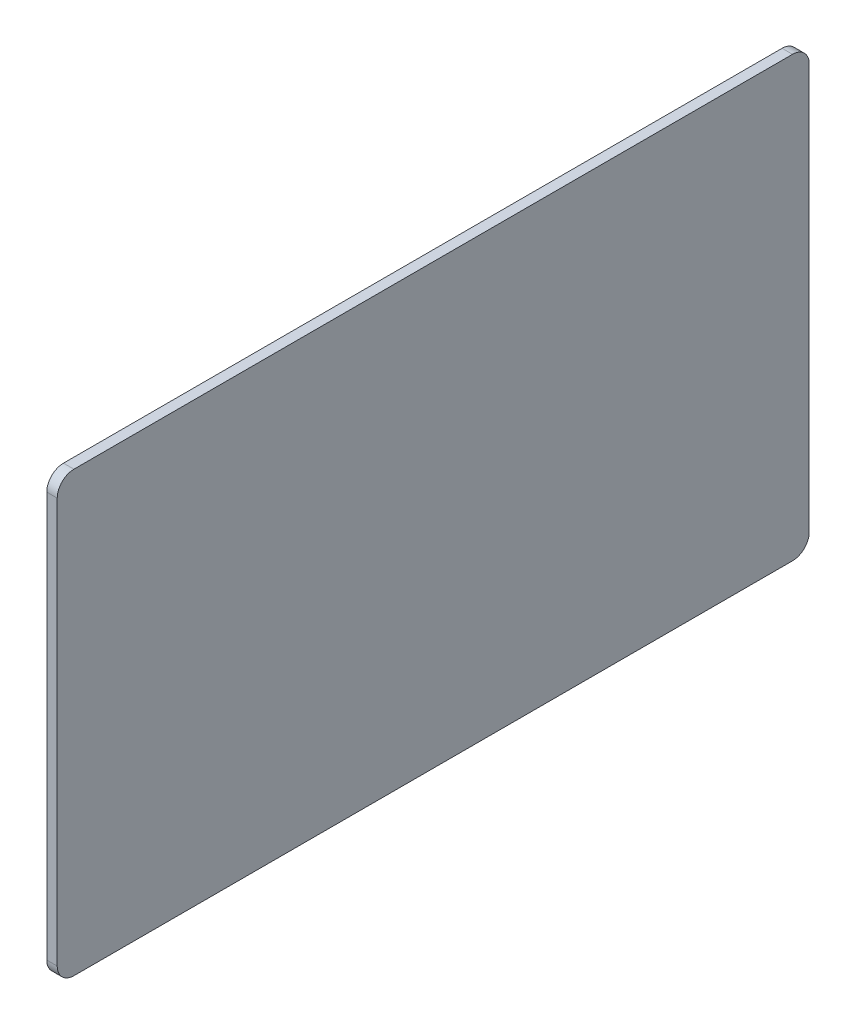
ISO-10303-21;
HEADER;
FILE_DESCRIPTION(('STEP AP214'),'2;1');
FILE_NAME('part.step','',(''),(''),'','','');
FILE_SCHEMA(('AUTOMOTIVE_DESIGN { 1 0 10303 214 1 1 1 1 }'));
ENDSEC;
DATA;
#1=APPLICATION_CONTEXT('core data for automotive mechanical design processes');
#2=APPLICATION_PROTOCOL_DEFINITION('international standard','automotive_design',2000,#1);
#3=PRODUCT_CONTEXT('',#1,'mechanical');
#4=PRODUCT('Part','Part','',(#3));
#5=PRODUCT_RELATED_PRODUCT_CATEGORY('part','',(#4));
#6=PRODUCT_DEFINITION_FORMATION('','',#4);
#7=PRODUCT_DEFINITION_CONTEXT('part definition',#1,'design');
#8=PRODUCT_DEFINITION('design','',#6,#7);
#9=PRODUCT_DEFINITION_SHAPE('','',#8);
#10=(LENGTH_UNIT() NAMED_UNIT(*) SI_UNIT(.MILLI.,.METRE.));
#11=(NAMED_UNIT(*) PLANE_ANGLE_UNIT() SI_UNIT($,.RADIAN.));
#12=(NAMED_UNIT(*) SI_UNIT($,.STERADIAN.) SOLID_ANGLE_UNIT());
#13=UNCERTAINTY_MEASURE_WITH_UNIT(LENGTH_MEASURE(1.E-05),#10,'distance_accuracy_value','');
#14=(GEOMETRIC_REPRESENTATION_CONTEXT(3) GLOBAL_UNCERTAINTY_ASSIGNED_CONTEXT((#13)) GLOBAL_UNIT_ASSIGNED_CONTEXT((#10,
#11,#12)) REPRESENTATION_CONTEXT('',''));
#15=CARTESIAN_POINT('',(0.,0.,0.));
#16=DIRECTION('',(0.,0.,1.));
#17=DIRECTION('',(1.,0.,0.));
#18=AXIS2_PLACEMENT_3D('',#15,#16,#17);
#19=CARTESIAN_POINT('',(1.5875,33.3375,-57.15));
#20=DIRECTION('',(0.,0.,1.));
#21=DIRECTION('',(1.,0.,0.));
#22=AXIS2_PLACEMENT_3D('',#19,#20,#21);
#23=PLANE('',#22);
#24=DIRECTION('',(0.,1.,0.));
#25=VECTOR('',#24,1.);
#26=CARTESIAN_POINT('',(1.5875,33.3375,-57.15));
#27=LINE('',#26,#25);
#28=CARTESIAN_POINT('',(1.5875,-30.7975,-57.15));
#29=VERTEX_POINT('',#28);
#30=CARTESIAN_POINT('',(1.5875,30.7975,-57.15));
#31=VERTEX_POINT('',#30);
#32=EDGE_CURVE('E125',#29,#31,#27,.T.);
#33=ORIENTED_EDGE('',*,*,#32,.F.);
#34=DIRECTION('',(-1.,0.,0.));
#35=VECTOR('',#34,1.);
#36=CARTESIAN_POINT('',(1.5875,-30.7975,-57.15));
#37=LINE('',#36,#35);
#38=CARTESIAN_POINT('',(0.,-30.7975,-57.15));
#39=VERTEX_POINT('',#38);
#40=EDGE_CURVE('E109',#29,#39,#37,.T.);
#41=ORIENTED_EDGE('',*,*,#40,.T.);
#42=DIRECTION('',(0.,1.,0.));
#43=VECTOR('',#42,1.);
#44=CARTESIAN_POINT('',(0.,33.3375,-57.15));
#45=LINE('',#44,#43);
#46=CARTESIAN_POINT('',(0.,30.7975,-57.15));
#47=VERTEX_POINT('',#46);
#48=EDGE_CURVE('E122',#39,#47,#45,.T.);
#49=ORIENTED_EDGE('',*,*,#48,.T.);
#50=DIRECTION('',(-1.,0.,0.));
#51=VECTOR('',#50,1.);
#52=CARTESIAN_POINT('',(1.5875,30.7975,-57.15));
#53=LINE('',#52,#51);
#54=EDGE_CURVE('E128',#47,#31,#53,.F.);
#55=ORIENTED_EDGE('',*,*,#54,.T.);
#56=EDGE_LOOP('',(#33,#41,#49,#55));
#57=FACE_BOUND('',#56,.T.);
#58=ADVANCED_FACE('F39',(#57),#23,.F.);
#59=CARTESIAN_POINT('',(1.5875,33.3375,57.15));
#60=DIRECTION('',(0.,-1.,0.));
#61=DIRECTION('',(0.,0.,-1.));
#62=AXIS2_PLACEMENT_3D('',#59,#60,#61);
#63=PLANE('',#62);
#64=DIRECTION('',(0.,0.,1.));
#65=VECTOR('',#64,1.);
#66=CARTESIAN_POINT('',(1.5875,33.3375,57.15));
#67=LINE('',#66,#65);
#68=CARTESIAN_POINT('',(1.5875,33.3375,-54.61));
#69=VERTEX_POINT('',#68);
#70=CARTESIAN_POINT('',(1.5875,33.3375,54.61));
#71=VERTEX_POINT('',#70);
#72=EDGE_CURVE('E196',#69,#71,#67,.T.);
#73=ORIENTED_EDGE('',*,*,#72,.F.);
#74=DIRECTION('',(-1.,0.,0.));
#75=VECTOR('',#74,1.);
#76=CARTESIAN_POINT('',(1.5875,33.3375,-54.61));
#77=LINE('',#76,#75);
#78=CARTESIAN_POINT('',(0.,33.3375,-54.61));
#79=VERTEX_POINT('',#78);
#80=EDGE_CURVE('E176',#69,#79,#77,.T.);
#81=ORIENTED_EDGE('',*,*,#80,.T.);
#82=DIRECTION('',(0.,0.,1.));
#83=VECTOR('',#82,1.);
#84=CARTESIAN_POINT('',(0.,33.3375,57.15));
#85=LINE('',#84,#83);
#86=CARTESIAN_POINT('',(0.,33.3375,54.61));
#87=VERTEX_POINT('',#86);
#88=EDGE_CURVE('E133',#79,#87,#85,.T.);
#89=ORIENTED_EDGE('',*,*,#88,.T.);
#90=DIRECTION('',(-1.,0.,0.));
#91=VECTOR('',#90,1.);
#92=CARTESIAN_POINT('',(1.5875,33.3375,54.61));
#93=LINE('',#92,#91);
#94=EDGE_CURVE('E173',#87,#71,#93,.F.);
#95=ORIENTED_EDGE('',*,*,#94,.T.);
#96=EDGE_LOOP('',(#73,#81,#89,#95));
#97=FACE_BOUND('',#96,.T.);
#98=ADVANCED_FACE('F208',(#97),#63,.F.);
#99=CARTESIAN_POINT('',(1.5875,33.3375,57.15));
#100=DIRECTION('',(0.,0.,-1.));
#101=DIRECTION('',(0.,1.,0.));
#102=AXIS2_PLACEMENT_3D('',#99,#100,#101);
#103=PLANE('',#102);
#104=DIRECTION('',(0.,-1.,0.));
#105=VECTOR('',#104,1.);
#106=CARTESIAN_POINT('',(0.,33.3375,57.15));
#107=LINE('',#106,#105);
#108=CARTESIAN_POINT('',(0.,30.7975,57.15));
#109=VERTEX_POINT('',#108);
#110=CARTESIAN_POINT('',(0.,-30.7975,57.15));
#111=VERTEX_POINT('',#110);
#112=EDGE_CURVE('E137',#109,#111,#107,.T.);
#113=ORIENTED_EDGE('',*,*,#112,.T.);
#114=DIRECTION('',(-1.,0.,0.));
#115=VECTOR('',#114,1.);
#116=CARTESIAN_POINT('',(1.5875,-30.7975,57.15));
#117=LINE('',#116,#115);
#118=CARTESIAN_POINT('',(1.5875,-30.7975,57.15));
#119=VERTEX_POINT('',#118);
#120=EDGE_CURVE('E11',#111,#119,#117,.F.);
#121=ORIENTED_EDGE('',*,*,#120,.T.);
#122=DIRECTION('',(0.,-1.,0.));
#123=VECTOR('',#122,1.);
#124=CARTESIAN_POINT('',(1.5875,33.3375,57.15));
#125=LINE('',#124,#123);
#126=CARTESIAN_POINT('',(1.5875,30.7975,57.15));
#127=VERTEX_POINT('',#126);
#128=EDGE_CURVE('E184',#127,#119,#125,.T.);
#129=ORIENTED_EDGE('',*,*,#128,.F.);
#130=DIRECTION('',(-1.,0.,0.));
#131=VECTOR('',#130,1.);
#132=CARTESIAN_POINT('',(1.5875,30.7975,57.15));
#133=LINE('',#132,#131);
#134=EDGE_CURVE('E48',#127,#109,#133,.T.);
#135=ORIENTED_EDGE('',*,*,#134,.T.);
#136=EDGE_LOOP('',(#113,#121,#129,#135));
#137=FACE_BOUND('',#136,.T.);
#138=ADVANCED_FACE('F183',(#137),#103,.F.);
#139=CARTESIAN_POINT('',(1.5875,-33.3375,57.15));
#140=DIRECTION('',(0.,1.,0.));
#141=DIRECTION('',(0.,0.,1.));
#142=AXIS2_PLACEMENT_3D('',#139,#140,#141);
#143=PLANE('',#142);
#144=DIRECTION('',(0.,0.,-1.));
#145=VECTOR('',#144,1.);
#146=CARTESIAN_POINT('',(0.,-33.3375,57.15));
#147=LINE('',#146,#145);
#148=CARTESIAN_POINT('',(0.,-33.3375,54.61));
#149=VERTEX_POINT('',#148);
#150=CARTESIAN_POINT('',(0.,-33.3375,-54.61));
#151=VERTEX_POINT('',#150);
#152=EDGE_CURVE('E145',#149,#151,#147,.T.);
#153=ORIENTED_EDGE('',*,*,#152,.T.);
#154=DIRECTION('',(-1.,0.,0.));
#155=VECTOR('',#154,1.);
#156=CARTESIAN_POINT('',(1.5875,-33.3375,-54.61));
#157=LINE('',#156,#155);
#158=CARTESIAN_POINT('',(1.5875,-33.3375,-54.61));
#159=VERTEX_POINT('',#158);
#160=EDGE_CURVE('E110',#151,#159,#157,.F.);
#161=ORIENTED_EDGE('',*,*,#160,.T.);
#162=DIRECTION('',(0.,0.,-1.));
#163=VECTOR('',#162,1.);
#164=CARTESIAN_POINT('',(1.5875,-33.3375,57.15));
#165=LINE('',#164,#163);
#166=CARTESIAN_POINT('',(1.5875,-33.3375,54.61));
#167=VERTEX_POINT('',#166);
#168=EDGE_CURVE('E140',#167,#159,#165,.T.);
#169=ORIENTED_EDGE('',*,*,#168,.F.);
#170=DIRECTION('',(-1.,0.,0.));
#171=VECTOR('',#170,1.);
#172=CARTESIAN_POINT('',(1.5875,-33.3375,54.61));
#173=LINE('',#172,#171);
#174=EDGE_CURVE('E116',#167,#149,#173,.T.);
#175=ORIENTED_EDGE('',*,*,#174,.T.);
#176=EDGE_LOOP('',(#153,#161,#169,#175));
#177=FACE_BOUND('',#176,.T.);
#178=ADVANCED_FACE('F192',(#177),#143,.F.);
#179=CARTESIAN_POINT('',(1.5875,0.,0.));
#180=DIRECTION('',(1.,0.,0.));
#181=DIRECTION('',(0.,0.,-1.));
#182=AXIS2_PLACEMENT_3D('',#179,#180,#181);
#183=PLANE('',#182);
#184=ORIENTED_EDGE('',*,*,#168,.T.);
#185=CARTESIAN_POINT('',(1.5875,-30.7975,-54.61));
#186=DIRECTION('',(1.,0.,0.));
#187=DIRECTION('',(0.,0.,-1.));
#188=AXIS2_PLACEMENT_3D('',#185,#186,#187);
#189=CIRCLE('',#188,2.54);
#190=EDGE_CURVE('E170',#159,#29,#189,.T.);
#191=ORIENTED_EDGE('',*,*,#190,.T.);
#192=ORIENTED_EDGE('',*,*,#32,.T.);
#193=CARTESIAN_POINT('',(1.5875,30.7975,-54.61));
#194=DIRECTION('',(1.,0.,0.));
#195=DIRECTION('',(0.,0.,-1.));
#196=AXIS2_PLACEMENT_3D('',#193,#194,#195);
#197=CIRCLE('',#196,2.54);
#198=EDGE_CURVE('E167',#31,#69,#197,.T.);
#199=ORIENTED_EDGE('',*,*,#198,.T.);
#200=ORIENTED_EDGE('',*,*,#72,.T.);
#201=CARTESIAN_POINT('',(1.5875,30.7975,54.61));
#202=DIRECTION('',(1.,0.,0.));
#203=DIRECTION('',(0.,0.,-1.));
#204=AXIS2_PLACEMENT_3D('',#201,#202,#203);
#205=CIRCLE('',#204,2.54);
#206=EDGE_CURVE('E60',#71,#127,#205,.T.);
#207=ORIENTED_EDGE('',*,*,#206,.T.);
#208=ORIENTED_EDGE('',*,*,#128,.T.);
#209=CARTESIAN_POINT('',(1.5875,-30.7975,54.61));
#210=DIRECTION('',(1.,0.,0.));
#211=DIRECTION('',(0.,0.,-1.));
#212=AXIS2_PLACEMENT_3D('',#209,#210,#211);
#213=CIRCLE('',#212,2.54);
#214=EDGE_CURVE('E164',#119,#167,#213,.T.);
#215=ORIENTED_EDGE('',*,*,#214,.T.);
#216=EDGE_LOOP('',(#184,#191,#192,#199,#200,#207,#208,#215));
#217=FACE_BOUND('',#216,.T.);
#218=ADVANCED_FACE('F202',(#217),#183,.T.);
#219=CARTESIAN_POINT('',(0.,0.,0.));
#220=DIRECTION('',(1.,0.,0.));
#221=DIRECTION('',(0.,0.,-1.));
#222=AXIS2_PLACEMENT_3D('',#219,#220,#221);
#223=PLANE('',#222);
#224=ORIENTED_EDGE('',*,*,#48,.F.);
#225=CARTESIAN_POINT('',(0.,-30.7975,-54.61));
#226=DIRECTION('',(1.,0.,0.));
#227=DIRECTION('',(0.,0.,-1.));
#228=AXIS2_PLACEMENT_3D('',#225,#226,#227);
#229=CIRCLE('',#228,2.54);
#230=EDGE_CURVE('E105',#39,#151,#229,.F.);
#231=ORIENTED_EDGE('',*,*,#230,.T.);
#232=ORIENTED_EDGE('',*,*,#152,.F.);
#233=CARTESIAN_POINT('',(0.,-30.7975,54.61));
#234=DIRECTION('',(1.,0.,0.));
#235=DIRECTION('',(0.,0.,-1.));
#236=AXIS2_PLACEMENT_3D('',#233,#234,#235);
#237=CIRCLE('',#236,2.54);
#238=EDGE_CURVE('E152',#149,#111,#237,.F.);
#239=ORIENTED_EDGE('',*,*,#238,.T.);
#240=ORIENTED_EDGE('',*,*,#112,.F.);
#241=CARTESIAN_POINT('',(0.,30.7975,54.61));
#242=DIRECTION('',(1.,0.,0.));
#243=DIRECTION('',(0.,0.,-1.));
#244=AXIS2_PLACEMENT_3D('',#241,#242,#243);
#245=CIRCLE('',#244,2.54);
#246=EDGE_CURVE('E127',#109,#87,#245,.F.);
#247=ORIENTED_EDGE('',*,*,#246,.T.);
#248=ORIENTED_EDGE('',*,*,#88,.F.);
#249=CARTESIAN_POINT('',(0.,30.7975,-54.61));
#250=DIRECTION('',(1.,0.,0.));
#251=DIRECTION('',(0.,0.,-1.));
#252=AXIS2_PLACEMENT_3D('',#249,#250,#251);
#253=CIRCLE('',#252,2.54);
#254=EDGE_CURVE('E117',#79,#47,#253,.F.);
#255=ORIENTED_EDGE('',*,*,#254,.T.);
#256=EDGE_LOOP('',(#224,#231,#232,#239,#240,#247,#248,#255));
#257=FACE_BOUND('',#256,.T.);
#258=ADVANCED_FACE('F130',(#257),#223,.F.);
#259=CARTESIAN_POINT('',(1.5875,-30.7975,-54.61));
#260=DIRECTION('',(-1.,0.,0.));
#261=DIRECTION('',(0.,0.,1.));
#262=AXIS2_PLACEMENT_3D('',#259,#260,#261);
#263=CYLINDRICAL_SURFACE('',#262,2.54);
#264=ORIENTED_EDGE('',*,*,#190,.F.);
#265=ORIENTED_EDGE('',*,*,#160,.F.);
#266=ORIENTED_EDGE('',*,*,#230,.F.);
#267=ORIENTED_EDGE('',*,*,#40,.F.);
#268=EDGE_LOOP('',(#264,#265,#266,#267));
#269=FACE_BOUND('',#268,.T.);
#270=ADVANCED_FACE('F108',(#269),#263,.T.);
#271=CARTESIAN_POINT('',(1.5875,30.7975,-54.61));
#272=DIRECTION('',(-1.,0.,0.));
#273=DIRECTION('',(0.,0.,1.));
#274=AXIS2_PLACEMENT_3D('',#271,#272,#273);
#275=CYLINDRICAL_SURFACE('',#274,2.54);
#276=ORIENTED_EDGE('',*,*,#198,.F.);
#277=ORIENTED_EDGE('',*,*,#54,.F.);
#278=ORIENTED_EDGE('',*,*,#254,.F.);
#279=ORIENTED_EDGE('',*,*,#80,.F.);
#280=EDGE_LOOP('',(#276,#277,#278,#279));
#281=FACE_BOUND('',#280,.T.);
#282=ADVANCED_FACE('F206',(#281),#275,.T.);
#283=CARTESIAN_POINT('',(1.5875,-30.7975,54.61));
#284=DIRECTION('',(-1.,0.,0.));
#285=DIRECTION('',(0.,0.,1.));
#286=AXIS2_PLACEMENT_3D('',#283,#284,#285);
#287=CYLINDRICAL_SURFACE('',#286,2.54);
#288=ORIENTED_EDGE('',*,*,#214,.F.);
#289=ORIENTED_EDGE('',*,*,#120,.F.);
#290=ORIENTED_EDGE('',*,*,#238,.F.);
#291=ORIENTED_EDGE('',*,*,#174,.F.);
#292=EDGE_LOOP('',(#288,#289,#290,#291));
#293=FACE_BOUND('',#292,.T.);
#294=ADVANCED_FACE('F189',(#293),#287,.T.);
#295=CARTESIAN_POINT('',(1.5875,30.7975,54.61));
#296=DIRECTION('',(-1.,0.,0.));
#297=DIRECTION('',(0.,0.,1.));
#298=AXIS2_PLACEMENT_3D('',#295,#296,#297);
#299=CYLINDRICAL_SURFACE('',#298,2.54);
#300=ORIENTED_EDGE('',*,*,#206,.F.);
#301=ORIENTED_EDGE('',*,*,#94,.F.);
#302=ORIENTED_EDGE('',*,*,#246,.F.);
#303=ORIENTED_EDGE('',*,*,#134,.F.);
#304=EDGE_LOOP('',(#300,#301,#302,#303));
#305=FACE_BOUND('',#304,.T.);
#306=ADVANCED_FACE('F41',(#305),#299,.T.);
#307=CLOSED_SHELL('',(#58,#98,#138,#178,#218,#258,#270,#282,#294,#306));
#308=MANIFOLD_SOLID_BREP('B2',#307);
#309=ADVANCED_BREP_SHAPE_REPRESENTATION('',(#18,#308),#14);
#310=SHAPE_DEFINITION_REPRESENTATION(#9,#309);
ENDSEC;
END-ISO-10303-21;
